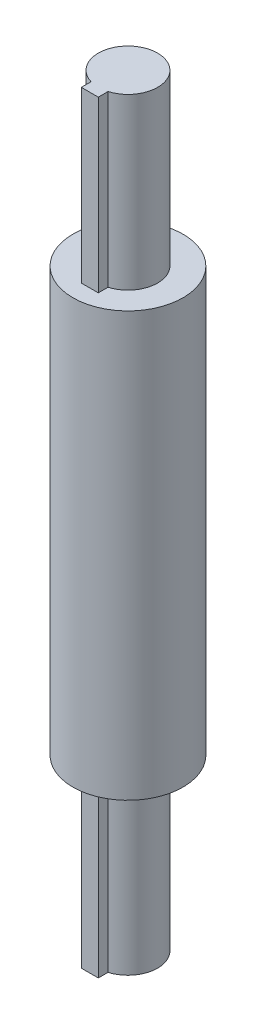
ISO-10303-21;
HEADER;
FILE_DESCRIPTION(('STEP AP214'),'2;1');
FILE_NAME('part.step','',(''),(''),'','','');
FILE_SCHEMA(('AUTOMOTIVE_DESIGN { 1 0 10303 214 1 1 1 1 }'));
ENDSEC;
DATA;
#1=APPLICATION_CONTEXT('core data for automotive mechanical design processes');
#2=APPLICATION_PROTOCOL_DEFINITION('international standard','automotive_design',2000,#1);
#3=PRODUCT_CONTEXT('',#1,'mechanical');
#4=PRODUCT('Part','Part','',(#3));
#5=PRODUCT_RELATED_PRODUCT_CATEGORY('part','',(#4));
#6=PRODUCT_DEFINITION_FORMATION('','',#4);
#7=PRODUCT_DEFINITION_CONTEXT('part definition',#1,'design');
#8=PRODUCT_DEFINITION('design','',#6,#7);
#9=PRODUCT_DEFINITION_SHAPE('','',#8);
#10=(LENGTH_UNIT() NAMED_UNIT(*) SI_UNIT(.MILLI.,.METRE.));
#11=(NAMED_UNIT(*) PLANE_ANGLE_UNIT() SI_UNIT($,.RADIAN.));
#12=(NAMED_UNIT(*) SI_UNIT($,.STERADIAN.) SOLID_ANGLE_UNIT());
#13=UNCERTAINTY_MEASURE_WITH_UNIT(LENGTH_MEASURE(1.E-05),#10,'distance_accuracy_value','');
#14=(GEOMETRIC_REPRESENTATION_CONTEXT(3) GLOBAL_UNCERTAINTY_ASSIGNED_CONTEXT((#13)) GLOBAL_UNIT_ASSIGNED_CONTEXT((#10,
#11,#12)) REPRESENTATION_CONTEXT('',''));
#15=CARTESIAN_POINT('',(0.,0.,0.));
#16=DIRECTION('',(0.,0.,1.));
#17=DIRECTION('',(1.,0.,0.));
#18=AXIS2_PLACEMENT_3D('',#15,#16,#17);
#19=CARTESIAN_POINT('',(0.,25.,0.));
#20=DIRECTION('',(0.,-1.,0.));
#21=DIRECTION('',(0.,0.,-1.));
#22=AXIS2_PLACEMENT_3D('',#19,#20,#21);
#23=CYLINDRICAL_SURFACE('',#22,3.25);
#24=CARTESIAN_POINT('',(0.,25.,0.));
#25=DIRECTION('',(0.,1.,0.));
#26=DIRECTION('',(0.,0.,1.));
#27=AXIS2_PLACEMENT_3D('',#24,#25,#26);
#28=CIRCLE('',#27,3.25);
#29=CARTESIAN_POINT('',(0.,25.,3.25));
#30=VERTEX_POINT('',#29);
#31=EDGE_CURVE('E183',#30,#30,#28,.T.);
#32=ORIENTED_EDGE('',*,*,#31,.F.);
#33=EDGE_LOOP('',(#32));
#34=FACE_BOUND('',#33,.T.);
#35=CARTESIAN_POINT('',(0.,0.,0.));
#36=DIRECTION('',(0.,1.,0.));
#37=DIRECTION('',(0.,0.,1.));
#38=AXIS2_PLACEMENT_3D('',#35,#36,#37);
#39=CIRCLE('',#38,3.25);
#40=CARTESIAN_POINT('',(0.,0.,3.25));
#41=VERTEX_POINT('',#40);
#42=EDGE_CURVE('E187',#41,#41,#39,.T.);
#43=ORIENTED_EDGE('',*,*,#42,.T.);
#44=EDGE_LOOP('',(#43));
#45=FACE_BOUND('',#44,.T.);
#46=ADVANCED_FACE('F38',(#34,#45),#23,.T.);
#47=CARTESIAN_POINT('',(0.,25.,0.));
#48=DIRECTION('',(0.,1.,0.));
#49=DIRECTION('',(0.,0.,1.));
#50=AXIS2_PLACEMENT_3D('',#47,#48,#49);
#51=PLANE('',#50);
#52=DIRECTION('',(0.,0.,-1.));
#53=VECTOR('',#52,1.);
#54=CARTESIAN_POINT('',(0.5,25.,0.));
#55=LINE('',#54,#53);
#56=CARTESIAN_POINT('',(0.5,25.,2.25));
#57=VERTEX_POINT('',#56);
#58=CARTESIAN_POINT('',(0.5,25.,1.67705098312484));
#59=VERTEX_POINT('',#58);
#60=EDGE_CURVE('E161',#57,#59,#55,.T.);
#61=ORIENTED_EDGE('',*,*,#60,.F.);
#62=DIRECTION('',(1.,0.,0.));
#63=VECTOR('',#62,1.);
#64=CARTESIAN_POINT('',(0.,25.,2.25));
#65=LINE('',#64,#63);
#66=CARTESIAN_POINT('',(-0.5,25.,2.25));
#67=VERTEX_POINT('',#66);
#68=EDGE_CURVE('E120',#67,#57,#65,.T.);
#69=ORIENTED_EDGE('',*,*,#68,.F.);
#70=DIRECTION('',(0.,0.,1.));
#71=VECTOR('',#70,1.);
#72=CARTESIAN_POINT('',(-0.5,25.,0.));
#73=LINE('',#72,#71);
#74=CARTESIAN_POINT('',(-0.5,25.,1.67705098312484));
#75=VERTEX_POINT('',#74);
#76=EDGE_CURVE('E150',#75,#67,#73,.T.);
#77=ORIENTED_EDGE('',*,*,#76,.F.);
#78=CARTESIAN_POINT('',(0.,25.,0.));
#79=DIRECTION('',(0.,1.,0.));
#80=DIRECTION('',(0.,0.,1.));
#81=AXIS2_PLACEMENT_3D('',#78,#79,#80);
#82=CIRCLE('',#81,1.75);
#83=EDGE_CURVE('E46',#59,#75,#82,.T.);
#84=ORIENTED_EDGE('',*,*,#83,.F.);
#85=EDGE_LOOP('',(#61,#69,#77,#84));
#86=FACE_BOUND('',#85,.T.);
#87=ORIENTED_EDGE('',*,*,#31,.T.);
#88=EDGE_LOOP('',(#87));
#89=FACE_BOUND('',#88,.T.);
#90=ADVANCED_FACE('F220',(#86,#89),#51,.T.);
#91=CARTESIAN_POINT('',(0.,0.,0.));
#92=DIRECTION('',(0.,1.,0.));
#93=DIRECTION('',(0.,0.,1.));
#94=AXIS2_PLACEMENT_3D('',#91,#92,#93);
#95=PLANE('',#94);
#96=DIRECTION('',(1.,0.,0.));
#97=VECTOR('',#96,1.);
#98=CARTESIAN_POINT('',(0.,0.,2.25));
#99=LINE('',#98,#97);
#100=CARTESIAN_POINT('',(-0.5,0.,2.25));
#101=VERTEX_POINT('',#100);
#102=CARTESIAN_POINT('',(0.5,0.,2.25));
#103=VERTEX_POINT('',#102);
#104=EDGE_CURVE('E11',#101,#103,#99,.T.);
#105=ORIENTED_EDGE('',*,*,#104,.T.);
#106=DIRECTION('',(0.,0.,-1.));
#107=VECTOR('',#106,1.);
#108=CARTESIAN_POINT('',(0.5,0.,0.));
#109=LINE('',#108,#107);
#110=CARTESIAN_POINT('',(0.5,0.,1.67705098312484));
#111=VERTEX_POINT('',#110);
#112=EDGE_CURVE('E168',#103,#111,#109,.T.);
#113=ORIENTED_EDGE('',*,*,#112,.T.);
#114=CARTESIAN_POINT('',(0.,0.,0.));
#115=DIRECTION('',(0.,1.,0.));
#116=DIRECTION('',(0.,0.,1.));
#117=AXIS2_PLACEMENT_3D('',#114,#115,#116);
#118=CIRCLE('',#117,1.75);
#119=CARTESIAN_POINT('',(-0.5,0.,1.67705098312484));
#120=VERTEX_POINT('',#119);
#121=EDGE_CURVE('E179',#111,#120,#118,.T.);
#122=ORIENTED_EDGE('',*,*,#121,.T.);
#123=DIRECTION('',(0.,0.,1.));
#124=VECTOR('',#123,1.);
#125=CARTESIAN_POINT('',(-0.5,0.,0.));
#126=LINE('',#125,#124);
#127=EDGE_CURVE('E56',#120,#101,#126,.T.);
#128=ORIENTED_EDGE('',*,*,#127,.T.);
#129=EDGE_LOOP('',(#105,#113,#122,#128));
#130=FACE_BOUND('',#129,.T.);
#131=ORIENTED_EDGE('',*,*,#42,.F.);
#132=EDGE_LOOP('',(#131));
#133=FACE_BOUND('',#132,.T.);
#134=ADVANCED_FACE('F192',(#130,#133),#95,.F.);
#135=CARTESIAN_POINT('',(0.,-10.,0.));
#136=DIRECTION('',(0.,1.,0.));
#137=DIRECTION('',(0.,0.,1.));
#138=AXIS2_PLACEMENT_3D('',#135,#136,#137);
#139=PLANE('',#138);
#140=CARTESIAN_POINT('',(0.,-10.,0.));
#141=DIRECTION('',(0.,1.,0.));
#142=DIRECTION('',(0.,0.,1.));
#143=AXIS2_PLACEMENT_3D('',#140,#141,#142);
#144=CIRCLE('',#143,1.75);
#145=CARTESIAN_POINT('',(0.5,-10.,1.67705098312484));
#146=VERTEX_POINT('',#145);
#147=CARTESIAN_POINT('',(-0.5,-10.,1.67705098312484));
#148=VERTEX_POINT('',#147);
#149=EDGE_CURVE('E176',#146,#148,#144,.T.);
#150=ORIENTED_EDGE('',*,*,#149,.F.);
#151=DIRECTION('',(0.,0.,1.));
#152=VECTOR('',#151,1.);
#153=CARTESIAN_POINT('',(0.5,-10.,1.25));
#154=LINE('',#153,#152);
#155=CARTESIAN_POINT('',(0.5,-10.,2.25));
#156=VERTEX_POINT('',#155);
#157=EDGE_CURVE('E133',#146,#156,#154,.T.);
#158=ORIENTED_EDGE('',*,*,#157,.T.);
#159=DIRECTION('',(-1.,0.,0.));
#160=VECTOR('',#159,1.);
#161=CARTESIAN_POINT('',(-0.5,-10.,2.25));
#162=LINE('',#161,#160);
#163=CARTESIAN_POINT('',(-0.5,-10.,2.25));
#164=VERTEX_POINT('',#163);
#165=EDGE_CURVE('E137',#156,#164,#162,.T.);
#166=ORIENTED_EDGE('',*,*,#165,.T.);
#167=DIRECTION('',(0.,0.,-1.));
#168=VECTOR('',#167,1.);
#169=CARTESIAN_POINT('',(-0.5,-10.,1.25));
#170=LINE('',#169,#168);
#171=EDGE_CURVE('E113',#164,#148,#170,.T.);
#172=ORIENTED_EDGE('',*,*,#171,.T.);
#173=EDGE_LOOP('',(#150,#158,#166,#172));
#174=FACE_BOUND('',#173,.T.);
#175=ADVANCED_FACE('F209',(#174),#139,.F.);
#176=CARTESIAN_POINT('',(0.,-10.,0.));
#177=DIRECTION('',(0.,1.,0.));
#178=DIRECTION('',(0.,0.,1.));
#179=AXIS2_PLACEMENT_3D('',#176,#177,#178);
#180=CYLINDRICAL_SURFACE('',#179,1.75);
#181=DIRECTION('',(0.,1.,0.));
#182=VECTOR('',#181,1.);
#183=CARTESIAN_POINT('',(0.5,-10.,1.67705098312484));
#184=LINE('',#183,#182);
#185=EDGE_CURVE('E164',#146,#111,#184,.T.);
#186=ORIENTED_EDGE('',*,*,#185,.F.);
#187=ORIENTED_EDGE('',*,*,#149,.T.);
#188=DIRECTION('',(0.,1.,0.));
#189=VECTOR('',#188,1.);
#190=CARTESIAN_POINT('',(-0.5,-10.,1.67705098312484));
#191=LINE('',#190,#189);
#192=EDGE_CURVE('E153',#120,#148,#191,.F.);
#193=ORIENTED_EDGE('',*,*,#192,.F.);
#194=ORIENTED_EDGE('',*,*,#121,.F.);
#195=EDGE_LOOP('',(#186,#187,#193,#194));
#196=FACE_BOUND('',#195,.T.);
#197=ADVANCED_FACE('F236',(#196),#180,.T.);
#198=DIRECTION('',(0.,1.,0.));
#199=VECTOR('',#198,1.);
#200=CARTESIAN_POINT('',(0.5,-10.,1.67705098312484));
#201=LINE('',#200,#199);
#202=CARTESIAN_POINT('',(0.5,35.,1.67705098312484));
#203=VERTEX_POINT('',#202);
#204=EDGE_CURVE('E106',#59,#203,#201,.T.);
#205=ORIENTED_EDGE('',*,*,#204,.F.);
#206=ORIENTED_EDGE('',*,*,#83,.T.);
#207=DIRECTION('',(0.,1.,0.));
#208=VECTOR('',#207,1.);
#209=CARTESIAN_POINT('',(-0.5,-10.,1.67705098312484));
#210=LINE('',#209,#208);
#211=CARTESIAN_POINT('',(-0.5,35.,1.67705098312484));
#212=VERTEX_POINT('',#211);
#213=EDGE_CURVE('E146',#212,#75,#210,.F.);
#214=ORIENTED_EDGE('',*,*,#213,.F.);
#215=CARTESIAN_POINT('',(0.,35.,0.));
#216=DIRECTION('',(0.,1.,0.));
#217=DIRECTION('',(0.,0.,1.));
#218=AXIS2_PLACEMENT_3D('',#215,#216,#217);
#219=CIRCLE('',#218,1.75);
#220=EDGE_CURVE('E173',#203,#212,#219,.T.);
#221=ORIENTED_EDGE('',*,*,#220,.F.);
#222=EDGE_LOOP('',(#205,#206,#214,#221));
#223=FACE_BOUND('',#222,.T.);
#224=ADVANCED_FACE('F239',(#223),#180,.T.);
#225=CARTESIAN_POINT('',(0.,35.,0.));
#226=DIRECTION('',(0.,1.,0.));
#227=DIRECTION('',(0.,0.,1.));
#228=AXIS2_PLACEMENT_3D('',#225,#226,#227);
#229=PLANE('',#228);
#230=ORIENTED_EDGE('',*,*,#220,.T.);
#231=DIRECTION('',(0.,0.,-1.));
#232=VECTOR('',#231,1.);
#233=CARTESIAN_POINT('',(-0.5,35.,1.25));
#234=LINE('',#233,#232);
#235=CARTESIAN_POINT('',(-0.5,35.,2.25));
#236=VERTEX_POINT('',#235);
#237=EDGE_CURVE('E127',#236,#212,#234,.T.);
#238=ORIENTED_EDGE('',*,*,#237,.F.);
#239=DIRECTION('',(-1.,0.,0.));
#240=VECTOR('',#239,1.);
#241=CARTESIAN_POINT('',(-0.5,35.,2.25));
#242=LINE('',#241,#240);
#243=CARTESIAN_POINT('',(0.5,35.,2.25));
#244=VERTEX_POINT('',#243);
#245=EDGE_CURVE('E112',#244,#236,#242,.T.);
#246=ORIENTED_EDGE('',*,*,#245,.F.);
#247=DIRECTION('',(0.,0.,1.));
#248=VECTOR('',#247,1.);
#249=CARTESIAN_POINT('',(0.5,35.,1.25));
#250=LINE('',#249,#248);
#251=EDGE_CURVE('E100',#203,#244,#250,.T.);
#252=ORIENTED_EDGE('',*,*,#251,.F.);
#253=EDGE_LOOP('',(#230,#238,#246,#252));
#254=FACE_BOUND('',#253,.T.);
#255=ADVANCED_FACE('F126',(#254),#229,.T.);
#256=CARTESIAN_POINT('',(-0.5,35.,1.25));
#257=DIRECTION('',(-1.,0.,0.));
#258=DIRECTION('',(0.,0.,1.));
#259=AXIS2_PLACEMENT_3D('',#256,#257,#258);
#260=PLANE('',#259);
#261=ORIENTED_EDGE('',*,*,#213,.T.);
#262=ORIENTED_EDGE('',*,*,#76,.T.);
#263=DIRECTION('',(0.,-1.,0.));
#264=VECTOR('',#263,1.);
#265=CARTESIAN_POINT('',(-0.5,35.,2.25));
#266=LINE('',#265,#264);
#267=EDGE_CURVE('E144',#236,#67,#266,.T.);
#268=ORIENTED_EDGE('',*,*,#267,.F.);
#269=ORIENTED_EDGE('',*,*,#237,.T.);
#270=EDGE_LOOP('',(#261,#262,#268,#269));
#271=FACE_BOUND('',#270,.T.);
#272=ADVANCED_FACE('F244',(#271),#260,.T.);
#273=CARTESIAN_POINT('',(0.5,35.,1.25));
#274=DIRECTION('',(1.,0.,0.));
#275=DIRECTION('',(0.,0.,-1.));
#276=AXIS2_PLACEMENT_3D('',#273,#274,#275);
#277=PLANE('',#276);
#278=DIRECTION('',(0.,-1.,0.));
#279=VECTOR('',#278,1.);
#280=CARTESIAN_POINT('',(0.5,35.,2.25));
#281=LINE('',#280,#279);
#282=EDGE_CURVE('E103',#244,#57,#281,.T.);
#283=ORIENTED_EDGE('',*,*,#282,.T.);
#284=ORIENTED_EDGE('',*,*,#60,.T.);
#285=ORIENTED_EDGE('',*,*,#204,.T.);
#286=ORIENTED_EDGE('',*,*,#251,.T.);
#287=EDGE_LOOP('',(#283,#284,#285,#286));
#288=FACE_BOUND('',#287,.T.);
#289=ADVANCED_FACE('F102',(#288),#277,.T.);
#290=CARTESIAN_POINT('',(-0.5,35.,2.25));
#291=DIRECTION('',(0.,0.,1.));
#292=DIRECTION('',(1.,0.,0.));
#293=AXIS2_PLACEMENT_3D('',#290,#291,#292);
#294=PLANE('',#293);
#295=ORIENTED_EDGE('',*,*,#267,.T.);
#296=ORIENTED_EDGE('',*,*,#68,.T.);
#297=ORIENTED_EDGE('',*,*,#282,.F.);
#298=ORIENTED_EDGE('',*,*,#245,.T.);
#299=EDGE_LOOP('',(#295,#296,#297,#298));
#300=FACE_BOUND('',#299,.T.);
#301=ADVANCED_FACE('F118',(#300),#294,.T.);
#302=ORIENTED_EDGE('',*,*,#104,.F.);
#303=EDGE_CURVE('E122',#101,#164,#266,.T.);
#304=ORIENTED_EDGE('',*,*,#303,.T.);
#305=ORIENTED_EDGE('',*,*,#165,.F.);
#306=EDGE_CURVE('E123',#103,#156,#281,.T.);
#307=ORIENTED_EDGE('',*,*,#306,.F.);
#308=EDGE_LOOP('',(#302,#304,#305,#307));
#309=FACE_BOUND('',#308,.T.);
#310=ADVANCED_FACE('F210',(#309),#294,.T.);
#311=ORIENTED_EDGE('',*,*,#112,.F.);
#312=ORIENTED_EDGE('',*,*,#306,.T.);
#313=ORIENTED_EDGE('',*,*,#157,.F.);
#314=ORIENTED_EDGE('',*,*,#185,.T.);
#315=EDGE_LOOP('',(#311,#312,#313,#314));
#316=FACE_BOUND('',#315,.T.);
#317=ADVANCED_FACE('F207',(#316),#277,.T.);
#318=ORIENTED_EDGE('',*,*,#127,.F.);
#319=ORIENTED_EDGE('',*,*,#192,.T.);
#320=ORIENTED_EDGE('',*,*,#171,.F.);
#321=ORIENTED_EDGE('',*,*,#303,.F.);
#322=EDGE_LOOP('',(#318,#319,#320,#321));
#323=FACE_BOUND('',#322,.T.);
#324=ADVANCED_FACE('F198',(#323),#260,.T.);
#325=CLOSED_SHELL('',(#46,#90,#134,#175,#197,#224,#255,#272,#289,#301,#310,#317,#324));
#326=MANIFOLD_SOLID_BREP('B2',#325);
#327=ADVANCED_BREP_SHAPE_REPRESENTATION('',(#18,#326),#14);
#328=SHAPE_DEFINITION_REPRESENTATION(#9,#327);
ENDSEC;
END-ISO-10303-21;
